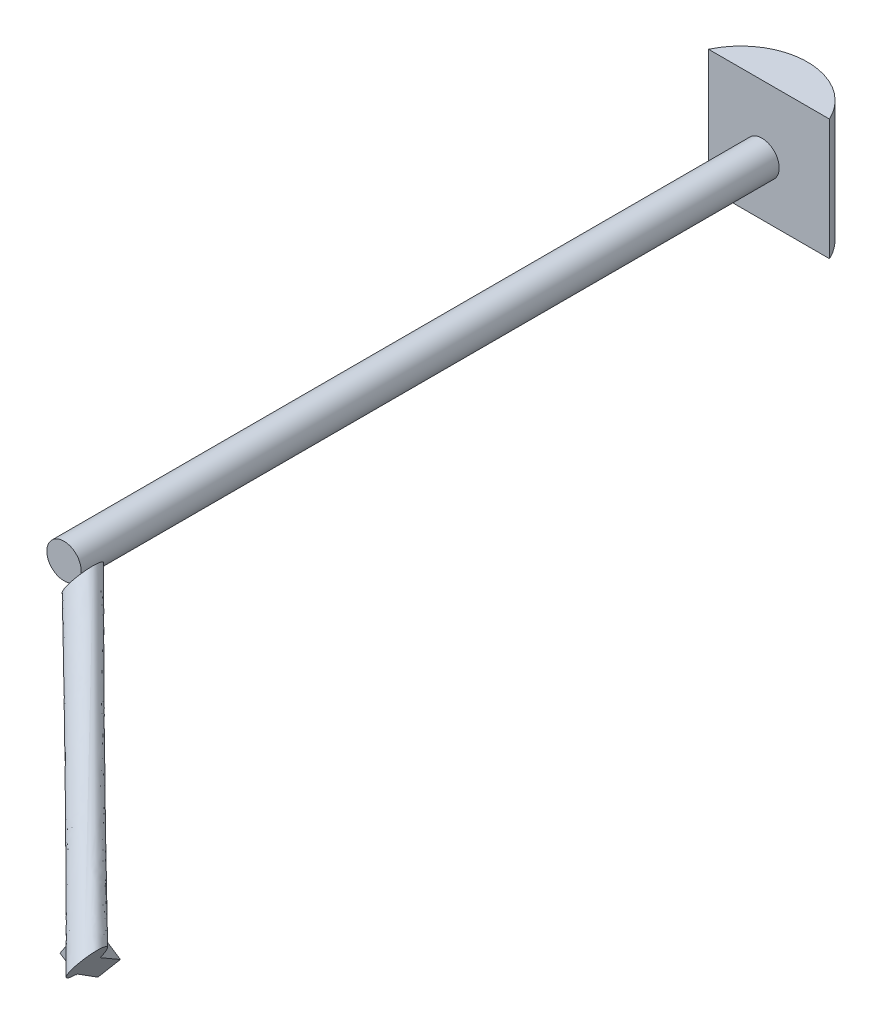
ISO-10303-21;
HEADER;
FILE_DESCRIPTION(('STEP AP214'),'2;1');
FILE_NAME('part.step','',(''),(''),'','','');
FILE_SCHEMA(('AUTOMOTIVE_DESIGN { 1 0 10303 214 1 1 1 1 }'));
ENDSEC;
DATA;
#1=APPLICATION_CONTEXT('core data for automotive mechanical design processes');
#2=APPLICATION_PROTOCOL_DEFINITION('international standard','automotive_design',2000,#1);
#3=PRODUCT_CONTEXT('',#1,'mechanical');
#4=PRODUCT('Part','Part','',(#3));
#5=PRODUCT_RELATED_PRODUCT_CATEGORY('part','',(#4));
#6=PRODUCT_DEFINITION_FORMATION('','',#4);
#7=PRODUCT_DEFINITION_CONTEXT('part definition',#1,'design');
#8=PRODUCT_DEFINITION('design','',#6,#7);
#9=PRODUCT_DEFINITION_SHAPE('','',#8);
#10=(LENGTH_UNIT() NAMED_UNIT(*) SI_UNIT(.MILLI.,.METRE.));
#11=(NAMED_UNIT(*) PLANE_ANGLE_UNIT() SI_UNIT($,.RADIAN.));
#12=(NAMED_UNIT(*) SI_UNIT($,.STERADIAN.) SOLID_ANGLE_UNIT());
#13=UNCERTAINTY_MEASURE_WITH_UNIT(LENGTH_MEASURE(1.E-05),#10,'distance_accuracy_value','');
#14=(GEOMETRIC_REPRESENTATION_CONTEXT(3) GLOBAL_UNCERTAINTY_ASSIGNED_CONTEXT((#13)) GLOBAL_UNIT_ASSIGNED_CONTEXT((#10,
#11,#12)) REPRESENTATION_CONTEXT('',''));
#15=CARTESIAN_POINT('',(0.,0.,0.));
#16=DIRECTION('',(0.,0.,1.));
#17=DIRECTION('',(1.,0.,0.));
#18=AXIS2_PLACEMENT_3D('',#15,#16,#17);
#19=CARTESIAN_POINT('',(1.50487061674003,-0.992963272771449,58.113090603571));
#20=DIRECTION('',(0.834673489347662,-0.550745100913479,0.));
#21=DIRECTION('',(0.550745100913479,0.834673489347662,0.));
#22=AXIS2_PLACEMENT_3D('',#19,#20,#21);
#23=PLANE('',#22);
#24=CARTESIAN_POINT('',(1.50487061674003,-0.992963272771449,58.113090603571));
#25=DIRECTION('',(0.834673489347662,-0.550745100913479,0.));
#26=DIRECTION('',(0.550745100913479,0.834673489347662,0.));
#27=AXIS2_PLACEMENT_3D('',#24,#25,#26);
#28=CIRCLE('',#27,1.91255995605533);
#29=CARTESIAN_POINT('',(2.5582036427408,0.603399819335863,58.113090603571));
#30=VERTEX_POINT('',#29);
#31=EDGE_CURVE('E208',#30,#30,#28,.T.);
#32=ORIENTED_EDGE('',*,*,#31,.F.);
#33=EDGE_LOOP('',(#32));
#34=FACE_BOUND('',#33,.T.);
#35=ADVANCED_FACE('F62',(#34),#23,.F.);
#36=CARTESIAN_POINT('',(22.7055772461707,-14.9818888359738,78.8962421260388));
#37=DIRECTION('',(0.834673489347662,-0.550745100913479,0.));
#38=DIRECTION('',(0.550745100913479,0.834673489347662,0.));
#39=AXIS2_PLACEMENT_3D('',#36,#37,#38);
#40=PLANE('',#39);
#41=CARTESIAN_POINT('',(22.7055772461707,-14.9818888359738,78.8962421260388));
#42=DIRECTION('',(0.834673489347662,-0.550745100913479,0.));
#43=DIRECTION('',(0.550745100913479,0.834673489347662,0.));
#44=AXIS2_PLACEMENT_3D('',#41,#42,#43);
#45=CIRCLE('',#44,1.91255995605533);
#46=CARTESIAN_POINT('',(22.7055772461707,-14.9818888359738,76.9836821699835));
#47=VERTEX_POINT('',#46);
#48=CARTESIAN_POINT('',(21.6522442201699,-16.5782519280811,78.8962421260388));
#49=VERTEX_POINT('',#48);
#50=EDGE_CURVE('E66',#47,#49,#45,.T.);
#51=ORIENTED_EDGE('',*,*,#50,.T.);
#52=DIRECTION('',(-0.550745100913479,-0.834673489347662,0.));
#53=VECTOR('',#52,1.);
#54=CARTESIAN_POINT('',(22.7055772461707,-14.9818888359738,78.8962421260388));
#55=LINE('',#54,#53);
#56=CARTESIAN_POINT('',(21.5762492683788,-16.6934249391149,78.8962421260388));
#57=VERTEX_POINT('',#56);
#58=EDGE_CURVE('E168',#49,#57,#55,.T.);
#59=ORIENTED_EDGE('',*,*,#58,.T.);
#60=DIRECTION('',(0.,0.,-1.));
#61=VECTOR('',#60,1.);
#62=CARTESIAN_POINT('',(21.5762492683788,-16.6934249391149,78.8962421260388));
#63=LINE('',#62,#61);
#64=CARTESIAN_POINT('',(21.5762492683788,-16.6934249391149,78.7582564196475));
#65=VERTEX_POINT('',#64);
#66=EDGE_CURVE('E147',#57,#65,#63,.T.);
#67=ORIENTED_EDGE('',*,*,#66,.T.);
#68=DIRECTION('',(-0.389435595561186,-0.590203284394363,-0.707106781186555));
#69=VECTOR('',#68,1.);
#70=CARTESIAN_POINT('',(21.5762492683788,-16.6934249391149,78.7582564196475));
#71=LINE('',#70,#69);
#72=CARTESIAN_POINT('',(18.9458440936556,-20.6798961068888,73.9821718564615));
#73=VERTEX_POINT('',#72);
#74=EDGE_CURVE('E191',#65,#73,#71,.T.);
#75=ORIENTED_EDGE('',*,*,#74,.T.);
#76=DIRECTION('',(0.389435595561194,0.590203284394376,-0.70710678118654));
#77=VECTOR('',#76,1.);
#78=CARTESIAN_POINT('',(18.9458440936556,-20.6798961068888,73.9821718564615));
#79=LINE('',#78,#77);
#80=CARTESIAN_POINT('',(19.7817553416658,-19.4130433341553,72.4643894075142));
#81=VERTEX_POINT('',#80);
#82=EDGE_CURVE('E195',#73,#81,#79,.T.);
#83=ORIENTED_EDGE('',*,*,#82,.T.);
#84=DIRECTION('',(0.381606671019488,0.578338275056613,0.721041738207967));
#85=VECTOR('',#84,1.);
#86=CARTESIAN_POINT('',(19.7817553416658,-19.4130433341553,72.4643894075142));
#87=LINE('',#86,#85);
#88=CARTESIAN_POINT('',(22.1409132572747,-15.8376568875444,76.921993148123));
#89=VERTEX_POINT('',#88);
#90=EDGE_CURVE('E362',#81,#89,#87,.T.);
#91=ORIENTED_EDGE('',*,*,#90,.T.);
#92=DIRECTION('',(0.550745100913479,0.834673489347662,0.));
#93=VECTOR('',#92,1.);
#94=CARTESIAN_POINT('',(22.7055772461707,-14.9818888359738,76.921993148123));
#95=LINE('',#94,#93);
#96=CARTESIAN_POINT('',(22.7055772461707,-14.9818888359738,76.921993148123));
#97=VERTEX_POINT('',#96);
#98=EDGE_CURVE('E173',#89,#97,#95,.T.);
#99=ORIENTED_EDGE('',*,*,#98,.T.);
#100=DIRECTION('',(0.,0.,1.));
#101=VECTOR('',#100,1.);
#102=CARTESIAN_POINT('',(22.7055772461707,-14.9818888359738,78.8962421260388));
#103=LINE('',#102,#101);
#104=EDGE_CURVE('E80',#97,#47,#103,.T.);
#105=ORIENTED_EDGE('',*,*,#104,.T.);
#106=EDGE_LOOP('',(#51,#59,#67,#75,#83,#91,#99,#105));
#107=FACE_BOUND('',#106,.T.);
#108=ADVANCED_FACE('F196',(#107),#40,.T.);
#109=CARTESIAN_POINT('',(23.7589102721714,-13.3855257438665,78.8962421260388));
#110=CARTESIAN_POINT('',(2.35312800885841,0.292600513760759,56.9792163896566));
#111=CARTESIAN_POINT('',(23.7589102721714,-13.3855257438665,78.7368621297009));
#112=CARTESIAN_POINT('',(2.30108836982796,0.213732618209991,56.8508664217811));
#113=CARTESIAN_POINT('',(23.748236497508,-13.4017022231999,78.5565714778434));
#114=CARTESIAN_POINT('',(2.23362545524991,0.111490208392769,56.7171668634879));
#115=CARTESIAN_POINT('',(23.6853174047548,-13.4970583119017,78.1648791988433));
#116=CARTESIAN_POINT('',(2.0550635968128,-0.159126541894989,56.4694640688148));
#117=CARTESIAN_POINT('',(23.6325103090513,-13.5770893149194,77.9527125477182));
#118=CARTESIAN_POINT('',(1.94326245874392,-0.328565082283652,56.3554494855031));
#119=CARTESIAN_POINT('',(23.4639770248912,-13.8325074096566,77.5446997570931));
#120=CARTESIAN_POINT('',(1.67431980008702,-0.736157100738772,56.2082934419679));
#121=CARTESIAN_POINT('',(23.3470534142542,-14.0097092366282,77.3498701200472));
#122=CARTESIAN_POINT('',(1.51654588722946,-0.975268991438179,56.1772595600693));
#123=CARTESIAN_POINT('',(23.0554733378526,-14.4516090545126,77.067508327227));
#124=CARTESIAN_POINT('',(1.18953935936419,-1.47085883726714,56.2637465966121));
#125=CARTESIAN_POINT('',(22.8811327505041,-14.7158283206226,76.9836821699835));
#126=CARTESIAN_POINT('',(1.02177118039432,-1.72511738829197,56.3839119534119));
#127=CARTESIAN_POINT('',(22.5300217418372,-15.247949351325,76.9836821699835));
#128=CARTESIAN_POINT('',(0.739018716354861,-2.15363865046937,56.7618700247167));
#129=CARTESIAN_POINT('',(22.3556811544887,-15.5121686174351,77.067508327227));
#130=CARTESIAN_POINT('',(0.625991195742287,-2.32493581655497,57.0170471124306));
#131=CARTESIAN_POINT('',(22.0641010780871,-15.9540684353194,77.3498701200471));
#132=CARTESIAN_POINT('',(0.48337425392264,-2.54107678679921,57.5583105057366));
#133=CARTESIAN_POINT('',(21.9471774674501,-16.1312702622911,77.5446997570931));
#134=CARTESIAN_POINT('',(0.452829155436554,-2.58736895334515,57.8410723100046));
#135=CARTESIAN_POINT('',(21.77864418329,-16.3866883570283,77.9527125477182));
#136=CARTESIAN_POINT('',(0.450329448615574,-2.59115734658034,58.3510681019923));
#137=CARTESIAN_POINT('',(21.7258370875865,-16.4667193600459,78.1648791988433));
#138=CARTESIAN_POINT('',(0.477078645501379,-2.55061800185464,58.5787724731525));
#139=CARTESIAN_POINT('',(21.6629179948334,-16.5620754487478,78.5565714778434));
#140=CARTESIAN_POINT('',(0.554302020826751,-2.43358327193126,58.9619354405813));
#141=CARTESIAN_POINT('',(21.6522442201699,-16.5782519280811,78.7368621297009));
#142=CARTESIAN_POINT('',(0.6045735855912,-2.35739495485442,59.1186148496098));
#143=CARTESIAN_POINT('',(21.6522442201699,-16.5782519280811,79.0556221223768));
#144=CARTESIAN_POINT('',(0.708652863652107,-2.19965916375289,59.3753147853609));
#145=CARTESIAN_POINT('',(21.6629179948334,-16.5620754487478,79.2359127742343));
#146=CARTESIAN_POINT('',(0.776115778230156,-2.09741675393567,59.5090143436541));
#147=CARTESIAN_POINT('',(21.7258370875865,-16.4667193600459,79.6276050532344));
#148=CARTESIAN_POINT('',(0.95467763666727,-1.82680000364791,59.7567171383272));
#149=CARTESIAN_POINT('',(21.77864418329,-16.3866883570283,79.8397717043595));
#150=CARTESIAN_POINT('',(1.06647877473615,-1.65736146325925,59.8707317216389));
#151=CARTESIAN_POINT('',(21.9471774674501,-16.1312702622911,80.2477844949846));
#152=CARTESIAN_POINT('',(1.33542143339305,-1.24976944480413,60.017887765174));
#153=CARTESIAN_POINT('',(22.0641010780871,-15.9540684353194,80.4426141320305));
#154=CARTESIAN_POINT('',(1.49319534625061,-1.01065755410472,60.0489216470726));
#155=CARTESIAN_POINT('',(22.3556811544887,-15.5121686174351,80.7249759248507));
#156=CARTESIAN_POINT('',(1.82020187411588,-0.515067708275757,59.9624346105299));
#157=CARTESIAN_POINT('',(22.5300217418372,-15.247949351325,80.8088020820942));
#158=CARTESIAN_POINT('',(1.98797005308575,-0.260809157250932,59.84226925373));
#159=CARTESIAN_POINT('',(22.8811327505041,-14.7158283206226,80.8088020820942));
#160=CARTESIAN_POINT('',(2.2707225171252,0.167712104926469,59.4643111824252));
#161=CARTESIAN_POINT('',(23.0554733378526,-14.4516090545126,80.7249759248507));
#162=CARTESIAN_POINT('',(2.38375003773778,0.339009271012077,59.2091340947113));
#163=CARTESIAN_POINT('',(23.3470534142542,-14.0097092366282,80.4426141320305));
#164=CARTESIAN_POINT('',(2.52636697955743,0.55515024125631,58.6678707014053));
#165=CARTESIAN_POINT('',(23.4639770248912,-13.8325074096566,80.2477844949846));
#166=CARTESIAN_POINT('',(2.55691207804351,0.601442407802254,58.3851088971374));
#167=CARTESIAN_POINT('',(23.6325103090513,-13.5770893149194,79.8397717043595));
#168=CARTESIAN_POINT('',(2.55941178486449,0.605230801037441,57.8751131051496));
#169=CARTESIAN_POINT('',(23.6853174047549,-13.4970583119017,79.6276050532344));
#170=CARTESIAN_POINT('',(2.53266258797869,0.56469145631174,57.6474087339895));
#171=CARTESIAN_POINT('',(23.748236497508,-13.4017022231999,79.2359127742343));
#172=CARTESIAN_POINT('',(2.45543921265331,0.447656726388363,57.2642457665607));
#173=CARTESIAN_POINT('',(23.7589102721714,-13.3855257438665,79.0556221223768));
#174=CARTESIAN_POINT('',(2.40516764788887,0.371468409311527,57.1075663575322));
#175=CARTESIAN_POINT('',(23.7589102721714,-13.3855257438665,78.8962421260388));
#176=CARTESIAN_POINT('',(2.35312800885841,0.292600513760759,56.9792163896566));
#177=B_SPLINE_SURFACE_WITH_KNOTS('',3,1,((#109,#110),(#111,#112),(#113,#114),(#115,#116),(#117,
#118),(#119,#120),(#121,#122),(#123,#124),(#125,#126),(#127,#128),(#129,#130),(#131,#132),(#133,
#134),(#135,#136),(#137,#138),(#139,#140),(#141,#142),(#143,#144),(#145,#146),(#147,#148),(#149,
#150),(#151,#152),(#153,#154),(#155,#156),(#157,#158),(#159,#160),(#161,#162),(#163,#164),(#165,
#166),(#167,#168),(#169,#170),(#171,#172),(#173,#174),(#175,#176)),.UNSPECIFIED.,.T.,.F.,.F.,(4,
2,2,2,2,2,2,2,2,2,2,2,2,2,2,2,4),(2,2),(0.,0.0625000000000001,0.125,0.1875,0.25,0.3125,0.375,
0.4375,0.5,0.5625,0.625,0.6875,0.75,0.8125,0.875,0.9375,1.),(0.,1.),.UNSPECIFIED.);
#178=CARTESIAN_POINT('',(21.6522442201699,-16.5782519280811,78.8962421260389));
#179=CARTESIAN_POINT('',(21.5867110993984,-16.5336714432404,78.8962421260388));
#180=CARTESIAN_POINT('',(21.5230250337972,-16.4863651627095,78.8962421260388));
#181=CARTESIAN_POINT('',(21.3998075896967,-16.386546785036,78.8962421260388));
#182=CARTESIAN_POINT('',(21.3402788549606,-16.3340314257492,78.8962421260388));
#183=CARTESIAN_POINT('',(21.2256375054139,-16.2238254962504,78.8962421260388));
#184=CARTESIAN_POINT('',(21.1705482065463,-16.1661105977836,78.8962421260388));
#185=CARTESIAN_POINT('',(21.065613258818,-16.0461568768887,78.8962421260388));
#186=CARTESIAN_POINT('',(21.0157659760857,-15.9839194743577,78.8962421260388));
#187=CARTESIAN_POINT('',(20.8909495026636,-15.8125685196915,78.8962421260388));
#188=CARTESIAN_POINT('',(20.8210878999298,-15.6996052750424,78.8962421260388));
#189=CARTESIAN_POINT('',(20.730919725398,-15.5229861065389,78.8962421260388));
#190=CARTESIAN_POINT('',(20.7033150105476,-15.4629610813058,78.8962421260388));
#191=CARTESIAN_POINT('',(20.6534513317615,-15.3407413251447,78.8962421260388));
#192=CARTESIAN_POINT('',(20.6311912545388,-15.2785470491678,78.8962421260389));
#193=CARTESIAN_POINT('',(20.5798566750489,-15.1116049611663,78.8962421260389));
#194=CARTESIAN_POINT('',(20.5556443509543,-15.0052788734709,78.8962421260388));
#195=CARTESIAN_POINT('',(20.5324137332643,-14.8439899813883,78.8962421260388));
#196=CARTESIAN_POINT('',(20.5268520523062,-14.7898968816219,78.8962421260388));
#197=CARTESIAN_POINT('',(20.5204093333024,-14.6814117275509,78.8962421260388));
#198=CARTESIAN_POINT('',(20.5195274609769,-14.6270197282626,78.8962421260388));
#199=CARTESIAN_POINT('',(20.521923152673,-14.5452938095353,78.8962421260388));
#200=CARTESIAN_POINT('',(20.5233576532461,-14.5178953601565,78.8962421260388));
#201=CARTESIAN_POINT('',(20.5275602656862,-14.4632012846637,78.8962421260388));
#202=CARTESIAN_POINT('',(20.5303283382219,-14.4359056555412,78.8962421260388));
#203=CARTESIAN_POINT('',(20.5406306738248,-14.3542557504606,78.8962421260388));
#204=CARTESIAN_POINT('',(20.5501630176799,-14.3001397871353,78.8962421260388));
#205=CARTESIAN_POINT('',(20.5744179599274,-14.1932490252068,78.8962421260388));
#206=CARTESIAN_POINT('',(20.5891266338248,-14.1404710317702,78.8962421260388));
#207=CARTESIAN_POINT('',(20.6236687464155,-14.0366486300636,78.8962421260388));
#208=CARTESIAN_POINT('',(20.643497630785,-13.9856027265557,78.8962421260389));
#209=CARTESIAN_POINT('',(20.6726629678038,-13.9204942096333,78.8962421260389));
#210=CARTESIAN_POINT('',(20.6797147476359,-13.9053827984035,78.8962421260388));
#211=CARTESIAN_POINT('',(20.6942783979481,-13.8754048233302,78.8962421260388));
#212=CARTESIAN_POINT('',(20.7017897304286,-13.860537998087,78.8962421260388));
#213=CARTESIAN_POINT('',(20.7095345655604,-13.8457908900284,78.8962421260388));
#214=B_SPLINE_CURVE_WITH_KNOTS('',3,(#178,#179,#180,#181,#182,#183,#184,#185,#186,#187,#188,
#189,#190,#191,#192,#193,#194,#195,#196,#197,#198,#199,#200,#201,#202,#203,#204,#205,#206,#207,
#208,#209,#210,#211,#212,#213),.UNSPECIFIED.,.F.,.F.,(4,2,2,2,2,2,2,2,2,2,2,2,2,2,2,2,2,4),(0.,
0.23771730663272,0.475584433167305,0.714628885388697,0.953598608193528,1.35013884013285,
1.54813676337945,1.74609340784759,2.07170256050215,2.23468609285748,2.39764056880534,
2.47992151048707,2.56220002558877,2.72676103121063,2.89088270414958,3.05485889404089,
3.10488060487239,3.15484483596942),.UNSPECIFIED.);
#215=CARTESIAN_POINT('',(20.5204729948448,-14.6039437401169,78.8962421260388));
#216=VERTEX_POINT('',#215);
#217=EDGE_CURVE('E13',#49,#216,#214,.T.);
#218=CARTESIAN_POINT('',(22.6415038314643,-14.9396110834171,76.921993148123));
#219=CARTESIAN_POINT('',(22.6628616363664,-14.9537036676026,76.9425561554098));
#220=CARTESIAN_POINT('',(22.6842194412685,-14.9677962517882,76.9631191626967));
#221=CARTESIAN_POINT('',(22.7055772461707,-14.9818888359738,76.9836821699835));
#222=B_SPLINE_CURVE_WITH_KNOTS('',3,(#218,#219,#220,#221),.UNSPECIFIED.,.F.,.F.,(4,4),(0.,
0.0984801820240596),.UNSPECIFIED.);
#223=CARTESIAN_POINT('',(22.6415038314643,-14.9396110834171,76.921993148123));
#224=VERTEX_POINT('',#223);
#225=EDGE_CURVE('E72',#224,#47,#222,.T.);
#226=CARTESIAN_POINT('',(20.4312924038048,-15.5884648578652,76.921993148123));
#227=CARTESIAN_POINT('',(20.4987692087004,-15.6081450498817,76.921993148123));
#228=CARTESIAN_POINT('',(20.5670482118556,-15.6251231394209,76.921993148123));
#229=CARTESIAN_POINT('',(20.7048626204065,-15.6533870665312,76.921993148123));
#230=CARTESIAN_POINT('',(20.7743995234946,-15.6646655829594,76.921993148123));
#231=CARTESIAN_POINT('',(20.9147236085345,-15.6812514157226,76.921993148123));
#232=CARTESIAN_POINT('',(20.9855162338593,-15.686513951123,76.921993148123));
#233=CARTESIAN_POINT('',(21.1272235147676,-15.6904295405728,76.921993148123));
#234=CARTESIAN_POINT('',(21.1981380686159,-15.6890866546498,76.921993148123));
#235=CARTESIAN_POINT('',(21.3772701226061,-15.6771057171552,76.921993148123));
#236=CARTESIAN_POINT('',(21.4852530165965,-15.6619007994503,76.921993148123));
#237=CARTESIAN_POINT('',(21.6441156243036,-15.6262401023495,76.921993148123));
#238=CARTESIAN_POINT('',(21.6965080838176,-15.6122282994239,76.921993148123));
#239=CARTESIAN_POINT('',(21.7999169670516,-15.5797802914474,76.921993148123));
#240=CARTESIAN_POINT('',(21.8509336483969,-15.5613449212342,76.921993148123));
#241=CARTESIAN_POINT('',(21.9515315101612,-15.5195933475964,76.921993148123));
#242=CARTESIAN_POINT('',(22.0010936765023,-15.4962309962394,76.921993148123));
#243=CARTESIAN_POINT('',(22.0977442320942,-15.4448761009203,76.921993148123));
#244=CARTESIAN_POINT('',(22.1448320197845,-15.4168824378125,76.921993148123));
#245=CARTESIAN_POINT('',(22.2816353688467,-15.326308901323,76.921993148123));
#246=CARTESIAN_POINT('',(22.3671085477968,-15.2570462782939,76.921993148123));
#247=CARTESIAN_POINT('',(22.4994058898324,-15.1252230449406,76.921993148123));
#248=CARTESIAN_POINT('',(22.5502235140724,-15.0666238069438,76.921993148123));
#249=CARTESIAN_POINT('',(22.6191911587418,-14.9733229976961,76.921993148123));
#250=CARTESIAN_POINT('',(22.6409869873621,-14.9412909916222,76.921993148123));
#251=CARTESIAN_POINT('',(22.6820215482514,-14.8755954481048,76.921993148123));
#252=CARTESIAN_POINT('',(22.7012583335444,-14.8419306947034,76.921993148123));
#253=CARTESIAN_POINT('',(22.7191415692862,-14.8075524075689,76.921993148123));
#254=B_SPLINE_CURVE_WITH_KNOTS('',3,(#226,#227,#228,#229,#230,#231,#232,#233,#234,#235,#236,
#237,#238,#239,#240,#241,#242,#243,#244,#245,#246,#247,#248,#249,#250,#251,#252,#253),
.UNSPECIFIED.,.F.,.F.,(4,2,2,2,2,2,2,2,2,2,2,2,2,4),(0.,0.210826048707666,0.421922221003544,
0.634579694799655,0.847106474842979,1.17274902465333,1.33529481030424,1.4978099435946,
1.66192082866313,1.82607142882635,2.15367690200765,2.38549788415623,2.5016185352134,
2.61782703419391),.UNSPECIFIED.);
#255=CARTESIAN_POINT('',(21.7660474354968,-15.5903080529654,76.921993148123));
#256=VERTEX_POINT('',#255);
#257=EDGE_CURVE('E88',#256,#224,#254,.T.);
#258=CARTESIAN_POINT('',(18.260035292743,-14.0693272736836,76.2337259088746));
#259=CARTESIAN_POINT('',(18.2712546284077,-14.1013463053121,76.2123447258649));
#260=CARTESIAN_POINT('',(18.2858905759005,-14.1332865545734,76.1929901012685));
#261=CARTESIAN_POINT('',(18.3205648234273,-14.1958623737777,76.1585102728401));
#262=CARTESIAN_POINT('',(18.3405287927671,-14.2265096374258,76.1433323116219));
#263=CARTESIAN_POINT('',(18.3921418548504,-14.2961620725634,76.1124138266109));
#264=CARTESIAN_POINT('',(18.4254696038496,-14.3345617490529,76.0981612977924));
#265=CARTESIAN_POINT('',(18.4973159903817,-14.4083246444234,76.0752686611341));
#266=CARTESIAN_POINT('',(18.5358664334326,-14.4436668949308,76.0666649944689));
#267=CARTESIAN_POINT('',(18.6117494926935,-14.5076451216929,76.0545846609119));
#268=CARTESIAN_POINT('',(18.6487563604982,-14.5365921146217,76.050651156987));
#269=CARTESIAN_POINT('',(18.7245608105644,-14.5923371379387,76.0456769977851));
#270=CARTESIAN_POINT('',(18.7633596592066,-14.6191336107947,76.0446384211437));
#271=CARTESIAN_POINT('',(18.8422550834561,-14.6707880114299,76.0449888102146));
#272=CARTESIAN_POINT('',(18.8823529443714,-14.6956439307542,76.0463802570744));
#273=CARTESIAN_POINT('',(18.9634366965421,-14.743614927491,76.0511841659671));
#274=CARTESIAN_POINT('',(19.0044224179909,-14.7667303340632,76.0545962447777));
#275=CARTESIAN_POINT('',(19.0914103453852,-14.8137993857789,76.0635673706882));
#276=CARTESIAN_POINT('',(19.1374844699984,-14.8375829200546,76.0693153913694));
#277=CARTESIAN_POINT('',(19.2301945286709,-14.8835275767952,76.0825426176506));
#278=CARTESIAN_POINT('',(19.2768305955679,-14.9056883065213,76.0900222405091));
#279=CARTESIAN_POINT('',(19.4174196217324,-14.970004471495,76.1147326773969));
#280=CARTESIAN_POINT('',(19.5119866497432,-15.0099585496744,76.1342274896583));
#281=CARTESIAN_POINT('',(19.7023893071704,-15.0852235840843,76.1779771156594));
#282=CARTESIAN_POINT('',(19.7982289347069,-15.1205100190462,76.2022555195783));
#283=CARTESIAN_POINT('',(19.9902443009934,-15.1869034585101,76.2546351450079));
#284=CARTESIAN_POINT('',(20.086419868542,-15.2180123419496,76.2827346363849));
#285=CARTESIAN_POINT('',(20.2950059500557,-15.2815191275443,76.3471185744932));
#286=CARTESIAN_POINT('',(20.4074356397567,-15.3132590838817,76.3839854922842));
#287=CARTESIAN_POINT('',(20.6322094085208,-15.3723185916436,76.4615097546356));
#288=CARTESIAN_POINT('',(20.7445534035331,-15.399635639804,76.5021692253193));
#289=CARTESIAN_POINT('',(20.9689709156284,-15.4503543601725,76.5867339823153));
#290=CARTESIAN_POINT('',(21.0810442436593,-15.4737538078089,76.6306410925048));
#291=CARTESIAN_POINT('',(21.3019112710513,-15.5163251811974,76.7202476482631));
#292=CARTESIAN_POINT('',(21.4107168615331,-15.5355882409861,76.7658747513286));
#293=CARTESIAN_POINT('',(21.6276649250366,-15.5707274897631,76.8596906924369));
#294=CARTESIAN_POINT('',(21.7358078477092,-15.5866062993841,76.9078775119446));
#295=CARTESIAN_POINT('',(21.9511865245146,-15.6149887807688,77.0066628242844));
#296=CARTESIAN_POINT('',(22.0584235916326,-15.6274986739282,77.0572566658115));
#297=CARTESIAN_POINT('',(22.1652445439505,-15.6383499957837,77.1090526316456));
#298=B_SPLINE_CURVE_WITH_KNOTS('',3,(#258,#259,#260,#261,#262,#263,#264,#265,#266,#267,#268,
#269,#270,#271,#272,#273,#274,#275,#276,#277,#278,#279,#280,#281,#282,#283,#284,#285,#286,#287,
#288,#289,#290,#291,#292,#293,#294,#295,#296,#297),.UNSPECIFIED.,.F.,.F.,(4,2,2,2,2,2,2,2,2,2,2,
2,2,2,2,2,2,2,2,4),(0.,0.119841914053303,0.23809219752733,0.39562381463441,0.554161945783533,
0.695408973389826,0.836757394064757,0.978250221301729,1.11971622234877,1.27615110520662,
1.43262372296513,1.74579592382328,2.06055303060135,2.37516809148146,2.74251760355678,
3.11007430564291,3.47783901852598,3.83640111491754,4.19468453765257,4.55230170732711),.UNSPECIFIED.);
#299=CARTESIAN_POINT('',(20.1106507820399,-15.2250436569509,76.2905145768176));
#300=VERTEX_POINT('',#299);
#301=EDGE_CURVE('E206',#300,#256,#298,.T.);
#302=CARTESIAN_POINT('',(21.0095207158162,-13.8627747909176,75.3487288330986));
#303=CARTESIAN_POINT('',(20.958902828451,-13.9394879720254,75.3485180484418));
#304=CARTESIAN_POINT('',(20.9083091278442,-14.0161644972535,75.3554525646073));
#305=CARTESIAN_POINT('',(20.8081734606266,-14.1679236080037,75.3826908326186));
#306=CARTESIAN_POINT('',(20.7586324014958,-14.243004818208,75.4030056724681));
#307=CARTESIAN_POINT('',(20.6824293470978,-14.358493216031,75.4447271627785));
#308=CARTESIAN_POINT('',(20.6550467930611,-14.3999924357011,75.4619484294483));
#309=CARTESIAN_POINT('',(20.601141961379,-14.4816870960406,75.5003948156086));
#310=CARTESIAN_POINT('',(20.574619614231,-14.5218826420436,75.521619610675));
#311=CARTESIAN_POINT('',(20.522663027653,-14.600624668694,75.5680772726989));
#312=CARTESIAN_POINT('',(20.4972286964754,-14.639171288388,75.5933098008532));
#313=CARTESIAN_POINT('',(20.4476599874011,-14.7142944030501,75.6476808528605));
#314=CARTESIAN_POINT('',(20.4235256593243,-14.7508708225143,75.6768195262595));
#315=CARTESIAN_POINT('',(20.3765694869203,-14.8220345463529,75.7388022783507));
#316=CARTESIAN_POINT('',(20.3537544098739,-14.8566115946762,75.7716632745919));
#317=CARTESIAN_POINT('',(20.3097161995652,-14.9233530447626,75.8407049273227));
#318=CARTESIAN_POINT('',(20.2884931675588,-14.955517293069,75.876885794635));
#319=CARTESIAN_POINT('',(20.2273860398785,-15.048127285242,75.9900628392201));
#320=CARTESIAN_POINT('',(20.1900339837188,-15.1047356345446,76.0717331414709));
#321=CARTESIAN_POINT('',(20.1400734651642,-15.1804525501965,76.2021865356067));
#322=CARTESIAN_POINT('',(20.1243788883685,-15.2042382310064,76.2471992419892));
#323=CARTESIAN_POINT('',(20.0951269862552,-15.2485705131572,76.3394811262072));
#324=CARTESIAN_POINT('',(20.0815697712412,-15.2691169473295,76.3867504203352));
#325=CARTESIAN_POINT('',(20.05672276095,-15.3067734616501,76.4832012516783));
#326=CARTESIAN_POINT('',(20.0454325986222,-15.3238840980768,76.5323824777973));
#327=CARTESIAN_POINT('',(20.0251838183246,-15.3545718337969,76.6323025479744));
#328=CARTESIAN_POINT('',(20.0162252309716,-15.3681488866897,76.6830414124766));
#329=CARTESIAN_POINT('',(20.0007402081183,-15.3916169811606,76.7854108817731));
#330=CARTESIAN_POINT('',(19.9941997915568,-15.4015292115265,76.837034495427));
#331=CARTESIAN_POINT('',(19.98351434008,-15.4177233874794,76.9410731162852));
#332=CARTESIAN_POINT('',(19.9793691411741,-15.4240055815999,76.9934880690576));
#333=CARTESIAN_POINT('',(19.9706755831336,-15.4371809732873,77.1514364565671));
#334=CARTESIAN_POINT('',(19.969857359507,-15.4384210198504,77.2577514041687));
#335=CARTESIAN_POINT('',(19.9758494408331,-15.4293398107382,77.4162901020061));
#336=CARTESIAN_POINT('',(19.9790630894392,-15.4244694137231,77.4690803881557));
#337=CARTESIAN_POINT('',(19.9879686749269,-15.4109726870135,77.5739877847196));
#338=CARTESIAN_POINT('',(19.9936604192894,-15.4023466490883,77.626104947104));
#339=CARTESIAN_POINT('',(20.0074622866243,-15.3814294357553,77.729253361538));
#340=CARTESIAN_POINT('',(20.0155719562427,-15.3691389474212,77.7802848152349));
#341=CARTESIAN_POINT('',(20.0341039814338,-15.3410530141913,77.880947200001));
#342=CARTESIAN_POINT('',(20.0445264751492,-15.3252573599355,77.9305780472138));
#343=CARTESIAN_POINT('',(20.0676152142262,-15.2902655672204,78.0279492251903));
#344=CARTESIAN_POINT('',(20.0802758213978,-15.2710779736354,78.0756939460493));
#345=CARTESIAN_POINT('',(20.1077609467703,-15.2294233035136,78.1690575036747));
#346=CARTESIAN_POINT('',(20.1225853981151,-15.2069563282992,78.2146764060648));
#347=CARTESIAN_POINT('',(20.1701755514428,-15.1348317841667,78.3479190746433));
#348=CARTESIAN_POINT('',(20.2060736755032,-15.0804269198822,78.4319945289447));
#349=CARTESIAN_POINT('',(20.2653124420062,-14.9906484945096,78.5486743462597));
#350=CARTESIAN_POINT('',(20.285940806655,-14.9593854854108,78.5859723430645));
#351=CARTESIAN_POINT('',(20.3288326025577,-14.8943814665078,78.6573589230319));
#352=CARTESIAN_POINT('',(20.3510961344219,-14.8606403042252,78.6914473084153));
#353=CARTESIAN_POINT('',(20.3971168783961,-14.7908942549339,78.756178905053));
#354=CARTESIAN_POINT('',(20.4208751266006,-14.7548877976876,78.7868196845727));
#355=CARTESIAN_POINT('',(20.4697172316572,-14.6808658768623,78.8443808853773));
#356=CARTESIAN_POINT('',(20.4948009435712,-14.6428506329423,78.8713017122764));
#357=CARTESIAN_POINT('',(20.5204729948448,-14.6039437401169,78.8962421260389));
#358=B_SPLINE_CURVE_WITH_KNOTS('',3,(#302,#303,#304,#305,#306,#307,#308,#309,#310,#311,#312,
#313,#314,#315,#316,#317,#318,#319,#320,#321,#322,#323,#324,#325,#326,#327,#328,#329,#330,#331,
#332,#333,#334,#335,#336,#337,#338,#339,#340,#341,#342,#343,#344,#345,#346,#347,#348,#349,#350,
#351,#352,#353,#354,#355,#356,#357),.UNSPECIFIED.,.F.,.F.,(4,2,2,2,2,2,2,2,2,2,2,2,2,2,2,2,2,2,
2,2,2,2,2,2,2,2,2,4),(0.,0.275395626490111,0.551019755383226,0.708725456309134,
0.866418383105344,1.02409798604128,1.1817836274337,1.34021709442073,1.49866062942915,
1.81534810453833,1.9750228286203,2.13470579038731,2.29436287754461,2.45402206110876,
2.61274315226354,2.77145337515414,3.08863411020889,3.24783221875866,3.40701796169044,
3.56617387650593,3.72533930010062,3.88410932895138,4.04287445334574,4.36019248550359,
4.51862759441438,4.67707245986641,4.83562839137884,4.99416702067944),.UNSPECIFIED.);
#359=EDGE_CURVE('E205',#300,#216,#358,.T.);
#360=ORIENTED_EDGE('',*,*,#217,.F.);
#361=ORIENTED_EDGE('',*,*,#50,.F.);
#362=ORIENTED_EDGE('',*,*,#225,.F.);
#363=ORIENTED_EDGE('',*,*,#257,.F.);
#364=ORIENTED_EDGE('',*,*,#301,.F.);
#365=ORIENTED_EDGE('',*,*,#359,.T.);
#366=EDGE_LOOP('',(#360,#361,#362,#363,#364,#365));
#367=FACE_BOUND('',#366,.T.);
#368=ORIENTED_EDGE('',*,*,#31,.T.);
#369=EDGE_LOOP('',(#368));
#370=FACE_BOUND('',#369,.T.);
#371=ADVANCED_FACE('F200',(#367,#370),#177,.T.);
#372=CARTESIAN_POINT('',(21.0095207158162,-13.8627747909176,78.8962421260388));
#373=DIRECTION('',(0.,0.,1.));
#374=DIRECTION('',(1.,0.,0.));
#375=AXIS2_PLACEMENT_3D('',#372,#373,#374);
#376=PLANE('',#375);
#377=ORIENTED_EDGE('',*,*,#58,.F.);
#378=ORIENTED_EDGE('',*,*,#217,.T.);
#379=DIRECTION('',(-0.550745100913479,-0.834673489347662,0.));
#380=VECTOR('',#379,1.);
#381=CARTESIAN_POINT('',(21.0095207158162,-13.8627747909176,78.8962421260388));
#382=LINE('',#381,#380);
#383=CARTESIAN_POINT('',(19.8801927380243,-15.5743108940587,78.8962421260388));
#384=VERTEX_POINT('',#383);
#385=EDGE_CURVE('E132',#216,#384,#382,.T.);
#386=ORIENTED_EDGE('',*,*,#385,.T.);
#387=DIRECTION('',(0.834673489347662,-0.550745100913479,0.));
#388=VECTOR('',#387,1.);
#389=CARTESIAN_POINT('',(19.8801927380243,-15.5743108940587,78.8962421260388));
#390=LINE('',#389,#388);
#391=EDGE_CURVE('E135',#384,#57,#390,.T.);
#392=ORIENTED_EDGE('',*,*,#391,.T.);
#393=EDGE_LOOP('',(#377,#378,#386,#392));
#394=FACE_BOUND('',#393,.T.);
#395=ADVANCED_FACE('F134',(#394),#376,.T.);
#396=CARTESIAN_POINT('',(21.0095207158162,-13.8627747909176,78.8962421260388));
#397=DIRECTION('',(0.550745100913479,0.834673489347662,0.));
#398=DIRECTION('',(-0.834673489347662,0.550745100913479,0.));
#399=AXIS2_PLACEMENT_3D('',#396,#397,#398);
#400=PLANE('',#399);
#401=DIRECTION('',(0.834673489347662,-0.550745100913479,0.));
#402=VECTOR('',#401,1.);
#403=CARTESIAN_POINT('',(21.0095207158162,-13.8627747909176,76.921993148123));
#404=LINE('',#403,#402);
#405=EDGE_CURVE('E181',#224,#97,#404,.T.);
#406=ORIENTED_EDGE('',*,*,#405,.F.);
#407=ORIENTED_EDGE('',*,*,#225,.T.);
#408=ORIENTED_EDGE('',*,*,#104,.F.);
#409=EDGE_LOOP('',(#406,#407,#408));
#410=FACE_BOUND('',#409,.T.);
#411=ADVANCED_FACE('F231',(#410),#400,.T.);
#412=CARTESIAN_POINT('',(21.0095207158162,-13.8627747909176,76.921993148123));
#413=DIRECTION('',(0.,0.,-1.));
#414=DIRECTION('',(-1.,0.,0.));
#415=AXIS2_PLACEMENT_3D('',#412,#413,#414);
#416=PLANE('',#415);
#417=DIRECTION('',(0.834673489347662,-0.550745100913479,0.));
#418=VECTOR('',#417,1.);
#419=CARTESIAN_POINT('',(20.4448567269203,-14.7185428424882,76.921993148123));
#420=LINE('',#419,#418);
#421=EDGE_CURVE('E183',#256,#89,#420,.T.);
#422=ORIENTED_EDGE('',*,*,#421,.F.);
#423=ORIENTED_EDGE('',*,*,#257,.T.);
#424=ORIENTED_EDGE('',*,*,#405,.T.);
#425=ORIENTED_EDGE('',*,*,#98,.F.);
#426=EDGE_LOOP('',(#422,#423,#424,#425));
#427=FACE_BOUND('',#426,.T.);
#428=ADVANCED_FACE('F235',(#427),#416,.T.);
#429=CARTESIAN_POINT('',(18.0856988113114,-18.2939292890992,72.4643894075142));
#430=DIRECTION('',(0.397110204872177,0.601834423595347,-0.692891630604696));
#431=DIRECTION('',(0.,0.754972298427664,0.655756683997084));
#432=AXIS2_PLACEMENT_3D('',#429,#430,#431);
#433=PLANE('',#432);
#434=DIRECTION('',(0.381606671019488,0.578338275056613,0.721041738207967));
#435=VECTOR('',#434,1.);
#436=CARTESIAN_POINT('',(18.0856988113114,-18.2939292890992,72.4643894075142));
#437=LINE('',#436,#435);
#438=CARTESIAN_POINT('',(18.0856988113114,-18.2939292890992,72.4643894075142));
#439=VERTEX_POINT('',#438);
#440=EDGE_CURVE('E149',#439,#300,#437,.T.);
#441=ORIENTED_EDGE('',*,*,#440,.T.);
#442=ORIENTED_EDGE('',*,*,#301,.T.);
#443=ORIENTED_EDGE('',*,*,#421,.T.);
#444=ORIENTED_EDGE('',*,*,#90,.F.);
#445=DIRECTION('',(0.834673489347662,-0.550745100913479,0.));
#446=VECTOR('',#445,1.);
#447=CARTESIAN_POINT('',(18.0856988113114,-18.2939292890992,72.4643894075142));
#448=LINE('',#447,#446);
#449=EDGE_CURVE('E185',#439,#81,#448,.T.);
#450=ORIENTED_EDGE('',*,*,#449,.F.);
#451=EDGE_LOOP('',(#441,#442,#443,#444,#450));
#452=FACE_BOUND('',#451,.T.);
#453=ADVANCED_FACE('F318',(#452),#433,.T.);
#454=CARTESIAN_POINT('',(17.2497875633012,-19.5607820618326,73.9821718564615));
#455=DIRECTION('',(-0.389435595561186,-0.590203284394363,-0.707106781186555));
#456=DIRECTION('',(0.,0.76771504393185,-0.640791394543277));
#457=AXIS2_PLACEMENT_3D('',#454,#455,#456);
#458=PLANE('',#457);
#459=ORIENTED_EDGE('',*,*,#82,.F.);
#460=DIRECTION('',(0.834673489347662,-0.550745100913479,0.));
#461=VECTOR('',#460,1.);
#462=CARTESIAN_POINT('',(17.2497875633012,-19.5607820618326,73.9821718564615));
#463=LINE('',#462,#461);
#464=CARTESIAN_POINT('',(17.2497875633012,-19.5607820618326,73.9821718564615));
#465=VERTEX_POINT('',#464);
#466=EDGE_CURVE('E187',#465,#73,#463,.T.);
#467=ORIENTED_EDGE('',*,*,#466,.F.);
#468=DIRECTION('',(0.389435595561194,0.590203284394376,-0.70710678118654));
#469=VECTOR('',#468,1.);
#470=CARTESIAN_POINT('',(17.2497875633012,-19.5607820618326,73.9821718564615));
#471=LINE('',#470,#469);
#472=EDGE_CURVE('E157',#465,#439,#471,.T.);
#473=ORIENTED_EDGE('',*,*,#472,.T.);
#474=ORIENTED_EDGE('',*,*,#449,.T.);
#475=EDGE_LOOP('',(#459,#467,#473,#474));
#476=FACE_BOUND('',#475,.T.);
#477=ADVANCED_FACE('F326',(#476),#458,.T.);
#478=CARTESIAN_POINT('',(19.8801927380243,-15.5743108940587,78.7582564196475));
#479=DIRECTION('',(-0.389435595561195,-0.590203284394376,0.70710678118654));
#480=DIRECTION('',(0.,-0.767715043931836,-0.640791394543294));
#481=AXIS2_PLACEMENT_3D('',#478,#479,#480);
#482=PLANE('',#481);
#483=ORIENTED_EDGE('',*,*,#74,.F.);
#484=DIRECTION('',(0.834673489347662,-0.550745100913479,0.));
#485=VECTOR('',#484,1.);
#486=CARTESIAN_POINT('',(19.8801927380243,-15.5743108940587,78.7582564196475));
#487=LINE('',#486,#485);
#488=CARTESIAN_POINT('',(19.8801927380243,-15.5743108940587,78.7582564196475));
#489=VERTEX_POINT('',#488);
#490=EDGE_CURVE('E148',#489,#65,#487,.T.);
#491=ORIENTED_EDGE('',*,*,#490,.F.);
#492=DIRECTION('',(-0.389435595561186,-0.590203284394363,-0.707106781186555));
#493=VECTOR('',#492,1.);
#494=CARTESIAN_POINT('',(19.8801927380243,-15.5743108940587,78.7582564196475));
#495=LINE('',#494,#493);
#496=EDGE_CURVE('E155',#489,#465,#495,.T.);
#497=ORIENTED_EDGE('',*,*,#496,.T.);
#498=ORIENTED_EDGE('',*,*,#466,.T.);
#499=EDGE_LOOP('',(#483,#491,#497,#498));
#500=FACE_BOUND('',#499,.T.);
#501=ADVANCED_FACE('F192',(#500),#482,.T.);
#502=CARTESIAN_POINT('',(19.8801927380243,-15.5743108940587,78.8962421260388));
#503=DIRECTION('',(-0.550745100913479,-0.834673489347662,0.));
#504=DIRECTION('',(0.834673489347662,-0.550745100913479,0.));
#505=AXIS2_PLACEMENT_3D('',#502,#503,#504);
#506=PLANE('',#505);
#507=ORIENTED_EDGE('',*,*,#66,.F.);
#508=ORIENTED_EDGE('',*,*,#391,.F.);
#509=DIRECTION('',(0.,0.,-1.));
#510=VECTOR('',#509,1.);
#511=CARTESIAN_POINT('',(19.8801927380243,-15.5743108940587,78.8962421260388));
#512=LINE('',#511,#510);
#513=EDGE_CURVE('E141',#384,#489,#512,.T.);
#514=ORIENTED_EDGE('',*,*,#513,.T.);
#515=ORIENTED_EDGE('',*,*,#490,.T.);
#516=EDGE_LOOP('',(#507,#508,#514,#515));
#517=FACE_BOUND('',#516,.T.);
#518=ADVANCED_FACE('F145',(#517),#506,.T.);
#519=CARTESIAN_POINT('',(21.0095207158162,-13.8627747909176,0.));
#520=DIRECTION('',(0.834673489347663,-0.550745100913479,0.));
#521=DIRECTION('',(0.550745100913479,0.834673489347662,0.));
#522=AXIS2_PLACEMENT_3D('',#519,#520,#521);
#523=PLANE('',#522);
#524=ORIENTED_EDGE('',*,*,#359,.F.);
#525=ORIENTED_EDGE('',*,*,#440,.F.);
#526=ORIENTED_EDGE('',*,*,#472,.F.);
#527=ORIENTED_EDGE('',*,*,#496,.F.);
#528=ORIENTED_EDGE('',*,*,#513,.F.);
#529=ORIENTED_EDGE('',*,*,#385,.F.);
#530=EDGE_LOOP('',(#524,#525,#526,#527,#528,#529));
#531=FACE_BOUND('',#530,.T.);
#532=ADVANCED_FACE('F152',(#531),#523,.F.);
#533=CLOSED_SHELL('',(#35,#108,#371,#395,#411,#428,#453,#477,#501,#518,#532));
#534=MANIFOLD_SOLID_BREP('B2',#533);
#535=CARTESIAN_POINT('',(0.,6.35,-12.4640755441796));
#536=DIRECTION('',(0.,-1.,0.));
#537=DIRECTION('',(0.,0.,-1.));
#538=AXIS2_PLACEMENT_3D('',#535,#536,#537);
#539=CYLINDRICAL_SURFACE('',#538,7.0119607149684);
#540=CARTESIAN_POINT('',(0.,-6.35,-12.4640755441796));
#541=DIRECTION('',(0.,1.,0.));
#542=DIRECTION('',(0.,0.,1.));
#543=AXIS2_PLACEMENT_3D('',#540,#541,#542);
#544=CIRCLE('',#543,7.0119607149684);
#545=CARTESIAN_POINT('',(-6.35,-6.35,-15.4381456624284));
#546=VERTEX_POINT('',#545);
#547=CARTESIAN_POINT('',(6.35,-6.35,-15.4381456624284));
#548=VERTEX_POINT('',#547);
#549=EDGE_CURVE('E427',#546,#548,#544,.F.);
#550=ORIENTED_EDGE('',*,*,#549,.F.);
#551=DIRECTION('',(0.,-1.,0.));
#552=VECTOR('',#551,1.);
#553=CARTESIAN_POINT('',(-6.35,6.35,-15.4381456624284));
#554=LINE('',#553,#552);
#555=CARTESIAN_POINT('',(-6.35,6.35,-15.4381456624284));
#556=VERTEX_POINT('',#555);
#557=EDGE_CURVE('E60',#556,#546,#554,.T.);
#558=ORIENTED_EDGE('',*,*,#557,.F.);
#559=CARTESIAN_POINT('',(0.,6.35,-12.4640755441796));
#560=DIRECTION('',(0.,1.,0.));
#561=DIRECTION('',(0.,0.,1.));
#562=AXIS2_PLACEMENT_3D('',#559,#560,#561);
#563=CIRCLE('',#562,7.0119607149684);
#564=CARTESIAN_POINT('',(6.35,6.35,-15.4381456624284));
#565=VERTEX_POINT('',#564);
#566=EDGE_CURVE('E430',#556,#565,#563,.F.);
#567=ORIENTED_EDGE('',*,*,#566,.T.);
#568=DIRECTION('',(0.,-1.,0.));
#569=VECTOR('',#568,1.);
#570=CARTESIAN_POINT('',(6.35,6.35,-15.4381456624284));
#571=LINE('',#570,#569);
#572=EDGE_CURVE('E412',#565,#548,#571,.T.);
#573=ORIENTED_EDGE('',*,*,#572,.T.);
#574=EDGE_LOOP('',(#550,#558,#567,#573));
#575=FACE_BOUND('',#574,.T.);
#576=ADVANCED_FACE('F404',(#575),#539,.T.);
#577=CARTESIAN_POINT('',(0.,6.35,-15.4381456624284));
#578=DIRECTION('',(0.,0.,1.));
#579=DIRECTION('',(1.,0.,0.));
#580=AXIS2_PLACEMENT_3D('',#577,#578,#579);
#581=PLANE('',#580);
#582=DIRECTION('',(-1.,0.,0.));
#583=VECTOR('',#582,1.);
#584=CARTESIAN_POINT('',(0.,-6.35,-15.4381456624284));
#585=LINE('',#584,#583);
#586=EDGE_CURVE('E435',#548,#546,#585,.T.);
#587=ORIENTED_EDGE('',*,*,#586,.F.);
#588=ORIENTED_EDGE('',*,*,#572,.F.);
#589=DIRECTION('',(-1.,0.,0.));
#590=VECTOR('',#589,1.);
#591=CARTESIAN_POINT('',(0.,6.35,-15.4381456624284));
#592=LINE('',#591,#590);
#593=EDGE_CURVE('E432',#565,#556,#592,.T.);
#594=ORIENTED_EDGE('',*,*,#593,.T.);
#595=ORIENTED_EDGE('',*,*,#557,.T.);
#596=EDGE_LOOP('',(#587,#588,#594,#595));
#597=FACE_BOUND('',#596,.T.);
#598=ADVANCED_FACE('F437',(#597),#581,.T.);
#599=CARTESIAN_POINT('',(0.,6.35,0.));
#600=DIRECTION('',(0.,1.,0.));
#601=DIRECTION('',(0.,0.,1.));
#602=AXIS2_PLACEMENT_3D('',#599,#600,#601);
#603=PLANE('',#602);
#604=ORIENTED_EDGE('',*,*,#566,.F.);
#605=ORIENTED_EDGE('',*,*,#593,.F.);
#606=EDGE_LOOP('',(#604,#605));
#607=FACE_BOUND('',#606,.T.);
#608=ADVANCED_FACE('F442',(#607),#603,.T.);
#609=CARTESIAN_POINT('',(0.,-6.35,0.));
#610=DIRECTION('',(0.,1.,0.));
#611=DIRECTION('',(0.,0.,1.));
#612=AXIS2_PLACEMENT_3D('',#609,#610,#611);
#613=PLANE('',#612);
#614=ORIENTED_EDGE('',*,*,#549,.T.);
#615=ORIENTED_EDGE('',*,*,#586,.T.);
#616=EDGE_LOOP('',(#614,#615));
#617=FACE_BOUND('',#616,.T.);
#618=ADVANCED_FACE('F434',(#617),#613,.F.);
#619=CLOSED_SHELL('',(#576,#598,#608,#618));
#620=MANIFOLD_SOLID_BREP('B7',#619);
#621=CARTESIAN_POINT('',(0.,0.,-14.7021785766718));
#622=DIRECTION('',(0.,0.,1.));
#623=DIRECTION('',(1.,0.,0.));
#624=AXIS2_PLACEMENT_3D('',#621,#622,#623);
#625=CYLINDRICAL_SURFACE('',#624,1.80294526655706);
#626=CARTESIAN_POINT('',(0.,0.,-14.7021785766718));
#627=DIRECTION('',(0.,0.,1.));
#628=DIRECTION('',(1.,0.,0.));
#629=AXIS2_PLACEMENT_3D('',#626,#627,#628);
#630=CIRCLE('',#629,1.80294526655706);
#631=CARTESIAN_POINT('',(1.80294526655706,0.,-14.7021785766718));
#632=VERTEX_POINT('',#631);
#633=EDGE_CURVE('E403',#632,#632,#630,.T.);
#634=CARTESIAN_POINT('',(0.,0.,58.5966300125152));
#635=DIRECTION('',(0.,0.,1.));
#636=DIRECTION('',(1.,0.,0.));
#637=AXIS2_PLACEMENT_3D('',#634,#635,#636);
#638=CIRCLE('',#637,1.80294526655706);
#639=CARTESIAN_POINT('',(1.80294526655706,0.,58.5966300125152));
#640=VERTEX_POINT('',#639);
#641=EDGE_CURVE('E485',#640,#640,#638,.T.);
#642=CARTESIAN_POINT('',(1.80294526655706,0.,-14.7021785766718));
#643=CARTESIAN_POINT('',(1.80294526655706,0.,-13.9386493205344));
#644=CARTESIAN_POINT('',(1.80294526655706,0.,-13.1751200643971));
#645=CARTESIAN_POINT('',(1.80294526655706,0.,-11.6480615521223));
#646=CARTESIAN_POINT('',(1.80294526655706,0.,-10.884532295985));
#647=CARTESIAN_POINT('',(1.80294526655706,0.,-9.35747378371024));
#648=CARTESIAN_POINT('',(1.80294526655706,0.,-8.59394452757287));
#649=CARTESIAN_POINT('',(1.80294526655706,0.,-7.06688601529814));
#650=CARTESIAN_POINT('',(1.80294526655706,0.,-6.30335675916078));
#651=CARTESIAN_POINT('',(1.80294526655706,0.,-4.77629824688605));
#652=CARTESIAN_POINT('',(1.80294526655706,0.,-4.01276899074869));
#653=CARTESIAN_POINT('',(1.80294526655706,0.,-2.48571047847396));
#654=CARTESIAN_POINT('',(1.80294526655706,0.,-1.72218122233659));
#655=CARTESIAN_POINT('',(1.80294526655706,0.,-0.195122710061865));
#656=CARTESIAN_POINT('',(1.80294526655706,0.,0.568406546075498));
#657=CARTESIAN_POINT('',(1.80294526655706,0.,2.09546505835023));
#658=CARTESIAN_POINT('',(1.80294526655706,0.,2.85899431448759));
#659=CARTESIAN_POINT('',(1.80294526655706,0.,4.38605282676232));
#660=CARTESIAN_POINT('',(1.80294526655706,0.,5.14958208289969));
#661=CARTESIAN_POINT('',(1.80294526655706,0.,6.67664059517441));
#662=CARTESIAN_POINT('',(1.80294526655706,0.,7.44016985131178));
#663=CARTESIAN_POINT('',(1.80294526655706,0.,8.96722836358651));
#664=CARTESIAN_POINT('',(1.80294526655706,0.,9.73075761972387));
#665=CARTESIAN_POINT('',(1.80294526655706,0.,11.2578161319986));
#666=CARTESIAN_POINT('',(1.80294526655706,0.,12.021345388136));
#667=CARTESIAN_POINT('',(1.80294526655706,0.,13.5484039004107));
#668=CARTESIAN_POINT('',(1.80294526655706,0.,14.3119331565481));
#669=CARTESIAN_POINT('',(1.80294526655706,0.,15.8389916688228));
#670=CARTESIAN_POINT('',(1.80294526655706,0.,16.6025209249601));
#671=CARTESIAN_POINT('',(1.80294526655706,0.,18.1295794372349));
#672=CARTESIAN_POINT('',(1.80294526655706,0.,18.8931086933722));
#673=CARTESIAN_POINT('',(1.80294526655706,0.,20.420167205647));
#674=CARTESIAN_POINT('',(1.80294526655706,0.,21.1836964617843));
#675=CARTESIAN_POINT('',(1.80294526655706,0.,22.7107549740591));
#676=CARTESIAN_POINT('',(1.80294526655706,0.,23.4742842301964));
#677=CARTESIAN_POINT('',(1.80294526655706,0.,25.0013427424712));
#678=CARTESIAN_POINT('',(1.80294526655706,0.,25.7648719986085));
#679=CARTESIAN_POINT('',(1.80294526655706,0.,27.2919305108832));
#680=CARTESIAN_POINT('',(1.80294526655706,0.,28.0554597670206));
#681=CARTESIAN_POINT('',(1.80294526655706,0.,29.5825182792953));
#682=CARTESIAN_POINT('',(1.80294526655706,0.,30.3460475354327));
#683=CARTESIAN_POINT('',(1.80294526655706,0.,31.8731060477074));
#684=CARTESIAN_POINT('',(1.80294526655706,0.,32.6366353038448));
#685=CARTESIAN_POINT('',(1.80294526655706,0.,34.1636938161195));
#686=CARTESIAN_POINT('',(1.80294526655706,0.,34.9272230722569));
#687=CARTESIAN_POINT('',(1.80294526655706,0.,36.4542815845316));
#688=CARTESIAN_POINT('',(1.80294526655706,0.,37.217810840669));
#689=CARTESIAN_POINT('',(1.80294526655706,0.,38.7448693529437));
#690=CARTESIAN_POINT('',(1.80294526655706,0.,39.5083986090811));
#691=CARTESIAN_POINT('',(1.80294526655706,0.,41.0354571213558));
#692=CARTESIAN_POINT('',(1.80294526655706,0.,41.7989863774932));
#693=CARTESIAN_POINT('',(1.80294526655706,0.,43.3260448897679));
#694=CARTESIAN_POINT('',(1.80294526655706,0.,44.0895741459053));
#695=CARTESIAN_POINT('',(1.80294526655706,0.,45.61663265818));
#696=CARTESIAN_POINT('',(1.80294526655706,0.,46.3801619143174));
#697=CARTESIAN_POINT('',(1.80294526655706,0.,47.9072204265921));
#698=CARTESIAN_POINT('',(1.80294526655706,0.,48.6707496827294));
#699=CARTESIAN_POINT('',(1.80294526655706,0.,50.1978081950042));
#700=CARTESIAN_POINT('',(1.80294526655706,0.,50.9613374511415));
#701=CARTESIAN_POINT('',(1.80294526655706,0.,52.4883959634163));
#702=CARTESIAN_POINT('',(1.80294526655706,0.,53.2519252195536));
#703=CARTESIAN_POINT('',(1.80294526655706,0.,54.7789837318284));
#704=CARTESIAN_POINT('',(1.80294526655706,0.,55.5425129879657));
#705=CARTESIAN_POINT('',(1.80294526655706,0.,57.0695715002404));
#706=CARTESIAN_POINT('',(1.80294526655706,0.,57.8331007563778));
#707=CARTESIAN_POINT('',(1.80294526655706,0.,58.5966300125152));
#708=B_SPLINE_CURVE_WITH_KNOTS('',3,(#642,#643,#644,#645,#646,#647,#648,#649,#650,#651,#652,
#653,#654,#655,#656,#657,#658,#659,#660,#661,#662,#663,#664,#665,#666,#667,#668,#669,#670,#671,
#672,#673,#674,#675,#676,#677,#678,#679,#680,#681,#682,#683,#684,#685,#686,#687,#688,#689,#690,
#691,#692,#693,#694,#695,#696,#697,#698,#699,#700,#701,#702,#703,#704,#705,#706,#707),
.UNSPECIFIED.,.F.,.F.,(4,2,2,2,2,2,2,2,2,2,2,2,2,2,2,2,2,2,2,2,2,2,2,2,2,2,2,2,2,2,2,2,4),(0.,
2.29058776841209,4.58117553682418,6.87176330523628,9.16235107364837,11.4529388420605,
13.7435266104726,16.0341143788846,18.3247021472967,20.6152899157088,22.9058776841209,
25.196465452533,27.4870532209451,29.7776409893572,32.0682287577693,34.3588165261814,
36.6494042945935,38.9399920630056,41.2305798314177,43.5211675998298,45.8117553682418,
48.1023431366539,50.392930905066,52.6835186734781,54.9741064418902,57.2646942103023,
59.5552819787144,61.8458697471265,64.1364575155386,66.4270452839507,68.7176330523628,
71.0082208207749,73.298808589187),.UNSPECIFIED.);
#709=EDGE_CURVE('BSEAM479',#632,#640,#708,.T.);
#710=ORIENTED_EDGE('',*,*,#633,.T.);
#711=ORIENTED_EDGE('',*,*,#641,.F.);
#712=ORIENTED_EDGE('',*,*,#709,.T.);
#713=ORIENTED_EDGE('',*,*,#709,.F.);
#714=EDGE_LOOP('',(#710,#712,#711,#713));
#715=FACE_BOUND('',#714,.T.);
#716=ADVANCED_FACE('F479',(#715),#625,.T.);
#717=CARTESIAN_POINT('',(0.,0.,-14.7021785766718));
#718=DIRECTION('',(0.,0.,1.));
#719=DIRECTION('',(1.,0.,0.));
#720=AXIS2_PLACEMENT_3D('',#717,#718,#719);
#721=PLANE('',#720);
#722=ORIENTED_EDGE('',*,*,#633,.F.);
#723=EDGE_LOOP('',(#722));
#724=FACE_BOUND('',#723,.T.);
#725=ADVANCED_FACE('F494',(#724),#721,.F.);
#726=CARTESIAN_POINT('',(0.,0.,58.5966300125152));
#727=DIRECTION('',(0.,0.,1.));
#728=DIRECTION('',(1.,0.,0.));
#729=AXIS2_PLACEMENT_3D('',#726,#727,#728);
#730=PLANE('',#729);
#731=ORIENTED_EDGE('',*,*,#641,.T.);
#732=EDGE_LOOP('',(#731));
#733=FACE_BOUND('',#732,.T.);
#734=ADVANCED_FACE('F491',(#733),#730,.T.);
#735=CLOSED_SHELL('',(#716,#725,#734));
#736=MANIFOLD_SOLID_BREP('B54',#735);
#737=ADVANCED_BREP_SHAPE_REPRESENTATION('',(#18,#534,#620,#736),#14);
#738=SHAPE_DEFINITION_REPRESENTATION(#9,#737);
ENDSEC;
END-ISO-10303-21;
